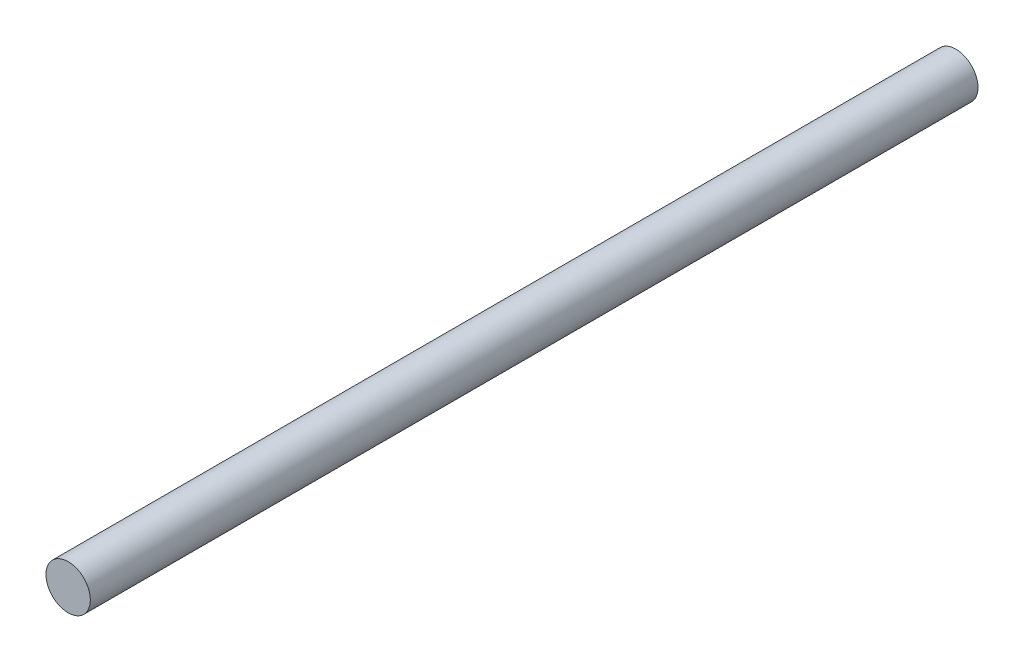
ISO-10303-21;
HEADER;
FILE_DESCRIPTION(('STEP AP214'),'2;1');
FILE_NAME('part.step','',(''),(''),'','','');
FILE_SCHEMA(('AUTOMOTIVE_DESIGN { 1 0 10303 214 1 1 1 1 }'));
ENDSEC;
DATA;
#1=APPLICATION_CONTEXT('core data for automotive mechanical design processes');
#2=APPLICATION_PROTOCOL_DEFINITION('international standard','automotive_design',2000,#1);
#3=PRODUCT_CONTEXT('',#1,'mechanical');
#4=PRODUCT('Part','Part','',(#3));
#5=PRODUCT_RELATED_PRODUCT_CATEGORY('part','',(#4));
#6=PRODUCT_DEFINITION_FORMATION('','',#4);
#7=PRODUCT_DEFINITION_CONTEXT('part definition',#1,'design');
#8=PRODUCT_DEFINITION('design','',#6,#7);
#9=PRODUCT_DEFINITION_SHAPE('','',#8);
#10=(LENGTH_UNIT() NAMED_UNIT(*) SI_UNIT(.MILLI.,.METRE.));
#11=(NAMED_UNIT(*) PLANE_ANGLE_UNIT() SI_UNIT($,.RADIAN.));
#12=(NAMED_UNIT(*) SI_UNIT($,.STERADIAN.) SOLID_ANGLE_UNIT());
#13=UNCERTAINTY_MEASURE_WITH_UNIT(LENGTH_MEASURE(1.E-05),#10,'distance_accuracy_value','');
#14=(GEOMETRIC_REPRESENTATION_CONTEXT(3) GLOBAL_UNCERTAINTY_ASSIGNED_CONTEXT((#13)) GLOBAL_UNIT_ASSIGNED_CONTEXT((#10,
#11,#12)) REPRESENTATION_CONTEXT('',''));
#15=CARTESIAN_POINT('',(0.,0.,0.));
#16=DIRECTION('',(0.,0.,1.));
#17=DIRECTION('',(1.,0.,0.));
#18=AXIS2_PLACEMENT_3D('',#15,#16,#17);
#19=CARTESIAN_POINT('',(0.,0.,300.));
#20=DIRECTION('',(0.,0.,-1.));
#21=DIRECTION('',(-1.,0.,0.));
#22=AXIS2_PLACEMENT_3D('',#19,#20,#21);
#23=CYLINDRICAL_SURFACE('',#22,7.5);
#24=CARTESIAN_POINT('',(0.,0.,300.));
#25=DIRECTION('',(0.,0.,1.));
#26=DIRECTION('',(1.,0.,0.));
#27=AXIS2_PLACEMENT_3D('',#24,#25,#26);
#28=CIRCLE('',#27,7.5);
#29=CARTESIAN_POINT('',(7.5,0.,300.));
#30=VERTEX_POINT('',#29);
#31=EDGE_CURVE('E10',#30,#30,#28,.T.);
#32=ORIENTED_EDGE('',*,*,#31,.F.);
#33=EDGE_LOOP('',(#32));
#34=FACE_BOUND('',#33,.T.);
#35=CARTESIAN_POINT('',(0.,0.,0.));
#36=DIRECTION('',(0.,0.,1.));
#37=DIRECTION('',(1.,0.,0.));
#38=AXIS2_PLACEMENT_3D('',#35,#36,#37);
#39=CIRCLE('',#38,7.5);
#40=CARTESIAN_POINT('',(7.5,0.,0.));
#41=VERTEX_POINT('',#40);
#42=EDGE_CURVE('E36',#41,#41,#39,.T.);
#43=ORIENTED_EDGE('',*,*,#42,.T.);
#44=EDGE_LOOP('',(#43));
#45=FACE_BOUND('',#44,.T.);
#46=ADVANCED_FACE('F33',(#34,#45),#23,.T.);
#47=CARTESIAN_POINT('',(0.,0.,300.));
#48=DIRECTION('',(0.,0.,1.));
#49=DIRECTION('',(1.,0.,0.));
#50=AXIS2_PLACEMENT_3D('',#47,#48,#49);
#51=PLANE('',#50);
#52=ORIENTED_EDGE('',*,*,#31,.T.);
#53=EDGE_LOOP('',(#52));
#54=FACE_BOUND('',#53,.T.);
#55=ADVANCED_FACE('F48',(#54),#51,.T.);
#56=CARTESIAN_POINT('',(0.,0.,0.));
#57=DIRECTION('',(0.,0.,1.));
#58=DIRECTION('',(1.,0.,0.));
#59=AXIS2_PLACEMENT_3D('',#56,#57,#58);
#60=PLANE('',#59);
#61=ORIENTED_EDGE('',*,*,#42,.F.);
#62=EDGE_LOOP('',(#61));
#63=FACE_BOUND('',#62,.T.);
#64=ADVANCED_FACE('F46',(#63),#60,.F.);
#65=CLOSED_SHELL('',(#46,#55,#64));
#66=MANIFOLD_SOLID_BREP('B2',#65);
#67=ADVANCED_BREP_SHAPE_REPRESENTATION('',(#18,#66),#14);
#68=SHAPE_DEFINITION_REPRESENTATION(#9,#67);
ENDSEC;
END-ISO-10303-21;
